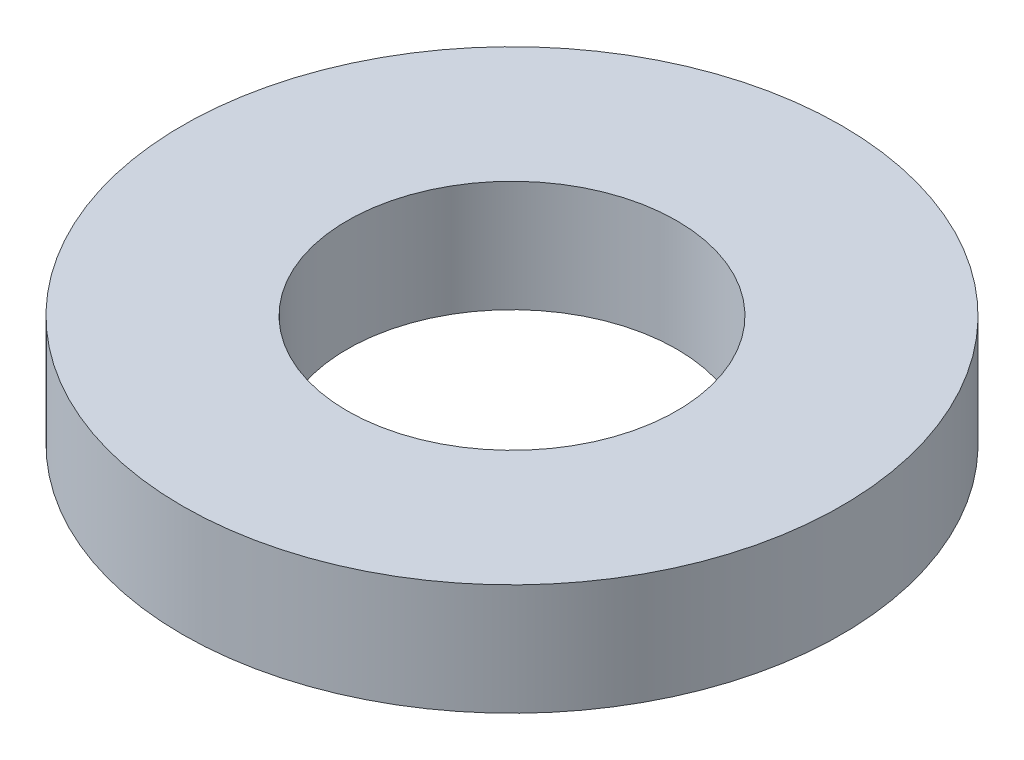
ISO-10303-21;
HEADER;
FILE_DESCRIPTION(('STEP AP214'),'2;1');
FILE_NAME('part.step','',(''),(''),'','','');
FILE_SCHEMA(('AUTOMOTIVE_DESIGN { 1 0 10303 214 1 1 1 1 }'));
ENDSEC;
DATA;
#1=APPLICATION_CONTEXT('core data for automotive mechanical design processes');
#2=APPLICATION_PROTOCOL_DEFINITION('international standard','automotive_design',2000,#1);
#3=PRODUCT_CONTEXT('',#1,'mechanical');
#4=PRODUCT('Part','Part','',(#3));
#5=PRODUCT_RELATED_PRODUCT_CATEGORY('part','',(#4));
#6=PRODUCT_DEFINITION_FORMATION('','',#4);
#7=PRODUCT_DEFINITION_CONTEXT('part definition',#1,'design');
#8=PRODUCT_DEFINITION('design','',#6,#7);
#9=PRODUCT_DEFINITION_SHAPE('','',#8);
#10=(LENGTH_UNIT() NAMED_UNIT(*) SI_UNIT(.MILLI.,.METRE.));
#11=(NAMED_UNIT(*) PLANE_ANGLE_UNIT() SI_UNIT($,.RADIAN.));
#12=(NAMED_UNIT(*) SI_UNIT($,.STERADIAN.) SOLID_ANGLE_UNIT());
#13=UNCERTAINTY_MEASURE_WITH_UNIT(LENGTH_MEASURE(1.E-05),#10,'distance_accuracy_value','');
#14=(GEOMETRIC_REPRESENTATION_CONTEXT(3) GLOBAL_UNCERTAINTY_ASSIGNED_CONTEXT((#13)) GLOBAL_UNIT_ASSIGNED_CONTEXT((#10,
#11,#12)) REPRESENTATION_CONTEXT('',''));
#15=CARTESIAN_POINT('',(0.,0.,0.));
#16=DIRECTION('',(0.,0.,1.));
#17=DIRECTION('',(1.,0.,0.));
#18=AXIS2_PLACEMENT_3D('',#15,#16,#17);
#19=CARTESIAN_POINT('',(0.,27.,0.));
#20=DIRECTION('',(0.,-1.,0.));
#21=DIRECTION('',(0.,0.,-1.));
#22=AXIS2_PLACEMENT_3D('',#19,#20,#21);
#23=CYLINDRICAL_SURFACE('',#22,80.);
#24=CARTESIAN_POINT('',(0.,27.,0.));
#25=DIRECTION('',(0.,1.,0.));
#26=DIRECTION('',(0.,0.,1.));
#27=AXIS2_PLACEMENT_3D('',#24,#25,#26);
#28=CIRCLE('',#27,80.);
#29=CARTESIAN_POINT('',(0.,27.,80.));
#30=VERTEX_POINT('',#29);
#31=EDGE_CURVE('E10',#30,#30,#28,.T.);
#32=ORIENTED_EDGE('',*,*,#31,.F.);
#33=EDGE_LOOP('',(#32));
#34=FACE_BOUND('',#33,.T.);
#35=CARTESIAN_POINT('',(0.,0.,0.));
#36=DIRECTION('',(0.,1.,0.));
#37=DIRECTION('',(0.,0.,1.));
#38=AXIS2_PLACEMENT_3D('',#35,#36,#37);
#39=CIRCLE('',#38,80.);
#40=CARTESIAN_POINT('',(0.,0.,80.));
#41=VERTEX_POINT('',#40);
#42=EDGE_CURVE('E37',#41,#41,#39,.T.);
#43=ORIENTED_EDGE('',*,*,#42,.T.);
#44=EDGE_LOOP('',(#43));
#45=FACE_BOUND('',#44,.T.);
#46=ADVANCED_FACE('F40',(#34,#45),#23,.T.);
#47=CARTESIAN_POINT('',(0.,27.,0.));
#48=DIRECTION('',(0.,1.,0.));
#49=DIRECTION('',(0.,0.,1.));
#50=AXIS2_PLACEMENT_3D('',#47,#48,#49);
#51=PLANE('',#50);
#52=CARTESIAN_POINT('',(0.,27.,0.));
#53=DIRECTION('',(0.,1.,0.));
#54=DIRECTION('',(0.,0.,1.));
#55=AXIS2_PLACEMENT_3D('',#52,#53,#54);
#56=CIRCLE('',#55,40.);
#57=CARTESIAN_POINT('',(0.,27.,40.));
#58=VERTEX_POINT('',#57);
#59=EDGE_CURVE('E50',#58,#58,#56,.T.);
#60=ORIENTED_EDGE('',*,*,#59,.F.);
#61=EDGE_LOOP('',(#60));
#62=FACE_BOUND('',#61,.T.);
#63=ORIENTED_EDGE('',*,*,#31,.T.);
#64=EDGE_LOOP('',(#63));
#65=FACE_BOUND('',#64,.T.);
#66=ADVANCED_FACE('F59',(#62,#65),#51,.T.);
#67=CARTESIAN_POINT('',(0.,0.,0.));
#68=DIRECTION('',(0.,1.,0.));
#69=DIRECTION('',(0.,0.,1.));
#70=AXIS2_PLACEMENT_3D('',#67,#68,#69);
#71=PLANE('',#70);
#72=CARTESIAN_POINT('',(0.,0.,0.));
#73=DIRECTION('',(0.,1.,0.));
#74=DIRECTION('',(0.,0.,1.));
#75=AXIS2_PLACEMENT_3D('',#72,#73,#74);
#76=CIRCLE('',#75,40.);
#77=CARTESIAN_POINT('',(0.,0.,40.));
#78=VERTEX_POINT('',#77);
#79=EDGE_CURVE('E47',#78,#78,#76,.T.);
#80=ORIENTED_EDGE('',*,*,#79,.T.);
#81=EDGE_LOOP('',(#80));
#82=FACE_BOUND('',#81,.T.);
#83=ORIENTED_EDGE('',*,*,#42,.F.);
#84=EDGE_LOOP('',(#83));
#85=FACE_BOUND('',#84,.T.);
#86=ADVANCED_FACE('F58',(#82,#85),#71,.F.);
#87=CARTESIAN_POINT('',(0.,27.,0.));
#88=DIRECTION('',(0.,-1.,0.));
#89=DIRECTION('',(0.,0.,-1.));
#90=AXIS2_PLACEMENT_3D('',#87,#88,#89);
#91=CYLINDRICAL_SURFACE('',#90,40.);
#92=ORIENTED_EDGE('',*,*,#59,.T.);
#93=EDGE_LOOP('',(#92));
#94=FACE_BOUND('',#93,.T.);
#95=ORIENTED_EDGE('',*,*,#79,.F.);
#96=EDGE_LOOP('',(#95));
#97=FACE_BOUND('',#96,.T.);
#98=ADVANCED_FACE('F54',(#94,#97),#91,.F.);
#99=CLOSED_SHELL('',(#46,#66,#86,#98));
#100=MANIFOLD_SOLID_BREP('B2',#99);
#101=ADVANCED_BREP_SHAPE_REPRESENTATION('',(#18,#100),#14);
#102=SHAPE_DEFINITION_REPRESENTATION(#9,#101);
ENDSEC;
END-ISO-10303-21;
